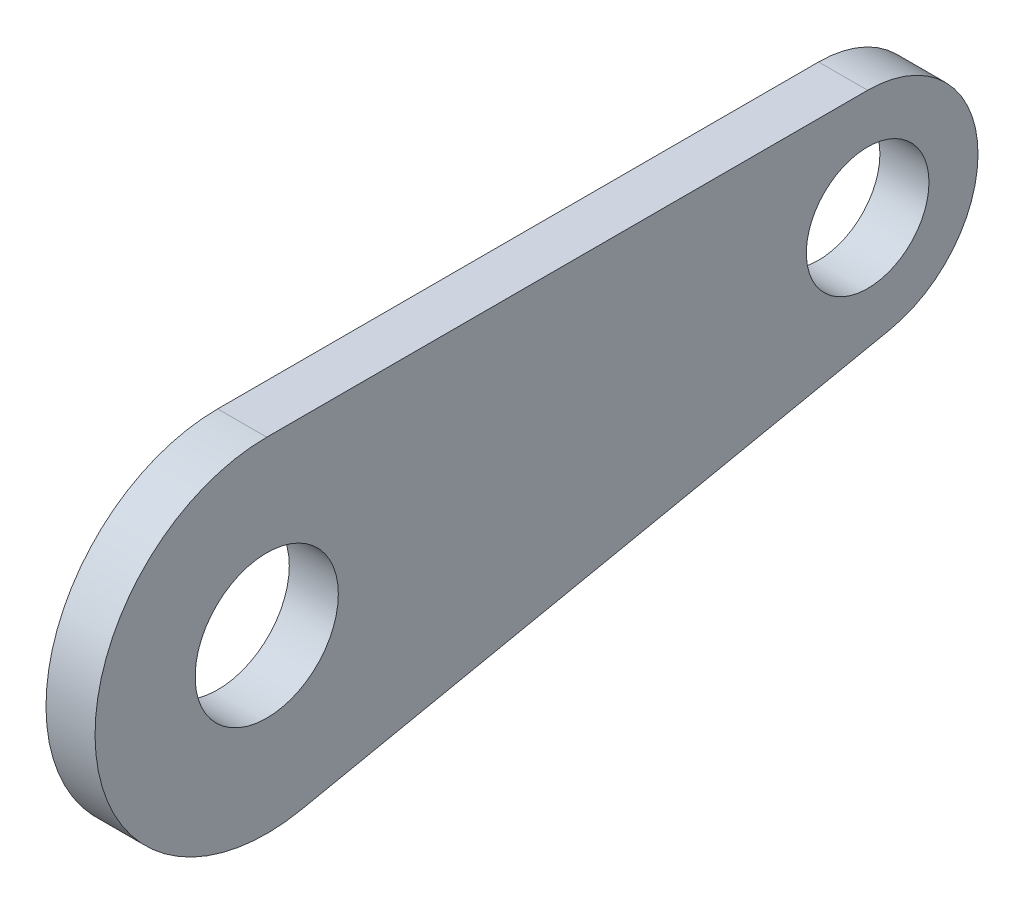
ISO-10303-21;
HEADER;
FILE_DESCRIPTION(('STEP AP214'),'2;1');
FILE_NAME('part.step','',(''),(''),'','','');
FILE_SCHEMA(('AUTOMOTIVE_DESIGN { 1 0 10303 214 1 1 1 1 }'));
ENDSEC;
DATA;
#1=APPLICATION_CONTEXT('core data for automotive mechanical design processes');
#2=APPLICATION_PROTOCOL_DEFINITION('international standard','automotive_design',2000,#1);
#3=PRODUCT_CONTEXT('',#1,'mechanical');
#4=PRODUCT('Part','Part','',(#3));
#5=PRODUCT_RELATED_PRODUCT_CATEGORY('part','',(#4));
#6=PRODUCT_DEFINITION_FORMATION('','',#4);
#7=PRODUCT_DEFINITION_CONTEXT('part definition',#1,'design');
#8=PRODUCT_DEFINITION('design','',#6,#7);
#9=PRODUCT_DEFINITION_SHAPE('','',#8);
#10=(LENGTH_UNIT() NAMED_UNIT(*) SI_UNIT(.MILLI.,.METRE.));
#11=(NAMED_UNIT(*) PLANE_ANGLE_UNIT() SI_UNIT($,.RADIAN.));
#12=(NAMED_UNIT(*) SI_UNIT($,.STERADIAN.) SOLID_ANGLE_UNIT());
#13=UNCERTAINTY_MEASURE_WITH_UNIT(LENGTH_MEASURE(1.E-05),#10,'distance_accuracy_value','');
#14=(GEOMETRIC_REPRESENTATION_CONTEXT(3) GLOBAL_UNCERTAINTY_ASSIGNED_CONTEXT((#13)) GLOBAL_UNIT_ASSIGNED_CONTEXT((#10,
#11,#12)) REPRESENTATION_CONTEXT('',''));
#15=CARTESIAN_POINT('',(0.,0.,0.));
#16=DIRECTION('',(0.,0.,1.));
#17=DIRECTION('',(1.,0.,0.));
#18=AXIS2_PLACEMENT_3D('',#15,#16,#17);
#19=CARTESIAN_POINT('',(-1.6129,0.,14.4455782844468));
#20=DIRECTION('',(1.,0.,0.));
#21=DIRECTION('',(0.,0.,-1.));
#22=AXIS2_PLACEMENT_3D('',#19,#20,#21);
#23=CYLINDRICAL_SURFACE('',#22,5.64642);
#24=CARTESIAN_POINT('',(0.,0.,14.4455782844468));
#25=DIRECTION('',(1.,0.,0.));
#26=DIRECTION('',(0.,0.,-1.));
#27=AXIS2_PLACEMENT_3D('',#24,#25,#26);
#28=CIRCLE('',#27,5.64642);
#29=CARTESIAN_POINT('',(0.,5.64642,14.4455782844468));
#30=VERTEX_POINT('',#29);
#31=CARTESIAN_POINT('',(0.,-5.53001142613113,13.3049501928854));
#32=VERTEX_POINT('',#31);
#33=EDGE_CURVE('E97',#30,#32,#28,.T.);
#34=ORIENTED_EDGE('',*,*,#33,.F.);
#35=DIRECTION('',(1.,0.,0.));
#36=VECTOR('',#35,1.);
#37=CARTESIAN_POINT('',(-1.6129,5.64642,14.4455782844468));
#38=LINE('',#37,#36);
#39=CARTESIAN_POINT('',(-1.6129,5.64642,14.4455782844468));
#40=VERTEX_POINT('',#39);
#41=EDGE_CURVE('E11',#40,#30,#38,.T.);
#42=ORIENTED_EDGE('',*,*,#41,.F.);
#43=CARTESIAN_POINT('',(-1.6129,0.,14.4455782844468));
#44=DIRECTION('',(1.,0.,0.));
#45=DIRECTION('',(0.,0.,-1.));
#46=AXIS2_PLACEMENT_3D('',#43,#44,#45);
#47=CIRCLE('',#46,5.64642);
#48=CARTESIAN_POINT('',(-1.6129,-5.53001142613113,13.3049501928854));
#49=VERTEX_POINT('',#48);
#50=EDGE_CURVE('E90',#40,#49,#47,.T.);
#51=ORIENTED_EDGE('',*,*,#50,.T.);
#52=DIRECTION('',(1.,0.,0.));
#53=VECTOR('',#52,1.);
#54=CARTESIAN_POINT('',(-1.6129,-5.53001142613113,13.3049501928854));
#55=LINE('',#54,#53);
#56=EDGE_CURVE('E35',#49,#32,#55,.T.);
#57=ORIENTED_EDGE('',*,*,#56,.T.);
#58=EDGE_LOOP('',(#34,#42,#51,#57));
#59=FACE_BOUND('',#58,.T.);
#60=ADVANCED_FACE('F32',(#59),#23,.T.);
#61=CARTESIAN_POINT('',(-1.6129,5.64642,14.4455782844468));
#62=DIRECTION('',(0.,1.,0.));
#63=DIRECTION('',(0.,0.,1.));
#64=AXIS2_PLACEMENT_3D('',#61,#62,#63);
#65=PLANE('',#64);
#66=DIRECTION('',(0.,0.,1.));
#67=VECTOR('',#66,1.);
#68=CARTESIAN_POINT('',(0.,5.64642,14.4455782844468));
#69=LINE('',#68,#67);
#70=CARTESIAN_POINT('',(0.,5.64642,-5.31562171555319));
#71=VERTEX_POINT('',#70);
#72=EDGE_CURVE('E92',#71,#30,#69,.T.);
#73=ORIENTED_EDGE('',*,*,#72,.F.);
#74=DIRECTION('',(1.,0.,0.));
#75=VECTOR('',#74,1.);
#76=CARTESIAN_POINT('',(-1.6129,5.64642,-5.31562171555319));
#77=LINE('',#76,#75);
#78=CARTESIAN_POINT('',(-1.6129,5.64642,-5.31562171555319));
#79=VERTEX_POINT('',#78);
#80=EDGE_CURVE('E41',#79,#71,#77,.T.);
#81=ORIENTED_EDGE('',*,*,#80,.F.);
#82=DIRECTION('',(0.,0.,1.));
#83=VECTOR('',#82,1.);
#84=CARTESIAN_POINT('',(-1.6129,5.64642,14.4455782844468));
#85=LINE('',#84,#83);
#86=EDGE_CURVE('E87',#79,#40,#85,.T.);
#87=ORIENTED_EDGE('',*,*,#86,.T.);
#88=ORIENTED_EDGE('',*,*,#41,.T.);
#89=EDGE_LOOP('',(#73,#81,#87,#88));
#90=FACE_BOUND('',#89,.T.);
#91=ADVANCED_FACE('F108',(#90),#65,.T.);
#92=CARTESIAN_POINT('',(-1.6129,2.01676,-5.31562171555319));
#93=DIRECTION('',(1.,0.,0.));
#94=DIRECTION('',(0.,0.,-1.));
#95=AXIS2_PLACEMENT_3D('',#92,#93,#94);
#96=CYLINDRICAL_SURFACE('',#95,3.62966);
#97=CARTESIAN_POINT('',(0.,2.01676,-5.31562171555319));
#98=DIRECTION('',(1.,0.,0.));
#99=DIRECTION('',(0.,0.,-1.));
#100=AXIS2_PLACEMENT_3D('',#97,#98,#99);
#101=CIRCLE('',#100,3.62966);
#102=CARTESIAN_POINT('',(0.,-1.53806965719361,-6.04884598133876));
#103=VERTEX_POINT('',#102);
#104=EDGE_CURVE('E82',#103,#71,#101,.T.);
#105=ORIENTED_EDGE('',*,*,#104,.F.);
#106=DIRECTION('',(1.,0.,0.));
#107=VECTOR('',#106,1.);
#108=CARTESIAN_POINT('',(-1.6129,-1.53806965719361,-6.04884598133876));
#109=LINE('',#108,#107);
#110=CARTESIAN_POINT('',(-1.6129,-1.53806965719361,-6.04884598133876));
#111=VERTEX_POINT('',#110);
#112=EDGE_CURVE('E77',#111,#103,#109,.T.);
#113=ORIENTED_EDGE('',*,*,#112,.F.);
#114=CARTESIAN_POINT('',(-1.6129,2.01676,-5.31562171555319));
#115=DIRECTION('',(1.,0.,0.));
#116=DIRECTION('',(0.,0.,-1.));
#117=AXIS2_PLACEMENT_3D('',#114,#115,#116);
#118=CIRCLE('',#117,3.62966);
#119=EDGE_CURVE('E80',#111,#79,#118,.T.);
#120=ORIENTED_EDGE('',*,*,#119,.T.);
#121=ORIENTED_EDGE('',*,*,#80,.T.);
#122=EDGE_LOOP('',(#105,#113,#120,#121));
#123=FACE_BOUND('',#122,.T.);
#124=ADVANCED_FACE('F79',(#123),#96,.T.);
#125=CARTESIAN_POINT('',(-1.6129,-5.53001142613113,13.3049501928854));
#126=DIRECTION('',(0.,-0.979383649486069,-0.202009076824157));
#127=DIRECTION('',(0.,0.202009076824157,-0.97938364948607));
#128=AXIS2_PLACEMENT_3D('',#125,#126,#127);
#129=PLANE('',#128);
#130=DIRECTION('',(0.,0.202009076824157,-0.979383649486069));
#131=VECTOR('',#130,1.);
#132=CARTESIAN_POINT('',(0.,-5.53001142613113,13.3049501928854));
#133=LINE('',#132,#131);
#134=EDGE_CURVE('E100',#32,#103,#133,.T.);
#135=ORIENTED_EDGE('',*,*,#134,.F.);
#136=ORIENTED_EDGE('',*,*,#56,.F.);
#137=DIRECTION('',(0.,0.202009076824157,-0.979383649486069));
#138=VECTOR('',#137,1.);
#139=CARTESIAN_POINT('',(-1.6129,-5.53001142613113,13.3049501928854));
#140=LINE('',#139,#138);
#141=EDGE_CURVE('E86',#49,#111,#140,.T.);
#142=ORIENTED_EDGE('',*,*,#141,.T.);
#143=ORIENTED_EDGE('',*,*,#112,.T.);
#144=EDGE_LOOP('',(#135,#136,#142,#143));
#145=FACE_BOUND('',#144,.T.);
#146=ADVANCED_FACE('F89',(#145),#129,.T.);
#147=CARTESIAN_POINT('',(-1.6129,0.,14.4455782844468));
#148=DIRECTION('',(1.,0.,0.));
#149=DIRECTION('',(0.,0.,-1.));
#150=AXIS2_PLACEMENT_3D('',#147,#148,#149);
#151=PLANE('',#150);
#152=CARTESIAN_POINT('',(-1.6129,2.01676,-5.31562171555319));
#153=DIRECTION('',(1.,0.,0.));
#154=DIRECTION('',(0.,0.,-1.));
#155=AXIS2_PLACEMENT_3D('',#152,#153,#154);
#156=CIRCLE('',#155,2.01676);
#157=CARTESIAN_POINT('',(-1.6129,2.01676,-7.33238171555319));
#158=VERTEX_POINT('',#157);
#159=EDGE_CURVE('E141',#158,#158,#156,.T.);
#160=ORIENTED_EDGE('',*,*,#159,.T.);
#161=EDGE_LOOP('',(#160));
#162=FACE_BOUND('',#161,.T.);
#163=CARTESIAN_POINT('',(-1.6129,0.,14.4455782844468));
#164=DIRECTION('',(1.,0.,0.));
#165=DIRECTION('',(0.,0.,-1.));
#166=AXIS2_PLACEMENT_3D('',#163,#164,#165);
#167=CIRCLE('',#166,2.35458);
#168=CARTESIAN_POINT('',(-1.6129,0.,12.0909982844468));
#169=VERTEX_POINT('',#168);
#170=EDGE_CURVE('E101',#169,#169,#167,.T.);
#171=ORIENTED_EDGE('',*,*,#170,.T.);
#172=EDGE_LOOP('',(#171));
#173=FACE_BOUND('',#172,.T.);
#174=ORIENTED_EDGE('',*,*,#50,.F.);
#175=ORIENTED_EDGE('',*,*,#86,.F.);
#176=ORIENTED_EDGE('',*,*,#119,.F.);
#177=ORIENTED_EDGE('',*,*,#141,.F.);
#178=EDGE_LOOP('',(#174,#175,#176,#177));
#179=FACE_BOUND('',#178,.T.);
#180=ADVANCED_FACE('F85',(#162,#173,#179),#151,.F.);
#181=CARTESIAN_POINT('',(0.,0.,14.4455782844468));
#182=DIRECTION('',(1.,0.,0.));
#183=DIRECTION('',(0.,0.,-1.));
#184=AXIS2_PLACEMENT_3D('',#181,#182,#183);
#185=PLANE('',#184);
#186=CARTESIAN_POINT('',(0.,2.01676,-5.31562171555319));
#187=DIRECTION('',(1.,0.,0.));
#188=DIRECTION('',(0.,0.,-1.));
#189=AXIS2_PLACEMENT_3D('',#186,#187,#188);
#190=CIRCLE('',#189,2.01676);
#191=CARTESIAN_POINT('',(0.,2.01676,-7.33238171555319));
#192=VERTEX_POINT('',#191);
#193=EDGE_CURVE('E144',#192,#192,#190,.T.);
#194=ORIENTED_EDGE('',*,*,#193,.F.);
#195=EDGE_LOOP('',(#194));
#196=FACE_BOUND('',#195,.T.);
#197=CARTESIAN_POINT('',(0.,0.,14.4455782844468));
#198=DIRECTION('',(1.,0.,0.));
#199=DIRECTION('',(0.,0.,-1.));
#200=AXIS2_PLACEMENT_3D('',#197,#198,#199);
#201=CIRCLE('',#200,2.35458);
#202=CARTESIAN_POINT('',(0.,0.,12.0909982844468));
#203=VERTEX_POINT('',#202);
#204=EDGE_CURVE('E146',#203,#203,#201,.T.);
#205=ORIENTED_EDGE('',*,*,#204,.F.);
#206=EDGE_LOOP('',(#205));
#207=FACE_BOUND('',#206,.T.);
#208=ORIENTED_EDGE('',*,*,#33,.T.);
#209=ORIENTED_EDGE('',*,*,#134,.T.);
#210=ORIENTED_EDGE('',*,*,#104,.T.);
#211=ORIENTED_EDGE('',*,*,#72,.T.);
#212=EDGE_LOOP('',(#208,#209,#210,#211));
#213=FACE_BOUND('',#212,.T.);
#214=ADVANCED_FACE('F107',(#196,#207,#213),#185,.T.);
#215=CARTESIAN_POINT('',(-1.6129,0.,14.4455782844468));
#216=DIRECTION('',(1.,0.,0.));
#217=DIRECTION('',(0.,0.,-1.));
#218=AXIS2_PLACEMENT_3D('',#215,#216,#217);
#219=CYLINDRICAL_SURFACE('',#218,2.35458);
#220=ORIENTED_EDGE('',*,*,#170,.F.);
#221=EDGE_LOOP('',(#220));
#222=FACE_BOUND('',#221,.T.);
#223=ORIENTED_EDGE('',*,*,#204,.T.);
#224=EDGE_LOOP('',(#223));
#225=FACE_BOUND('',#224,.T.);
#226=ADVANCED_FACE('F126',(#222,#225),#219,.F.);
#227=CARTESIAN_POINT('',(-1.6129,2.01676,-5.31562171555319));
#228=DIRECTION('',(1.,0.,0.));
#229=DIRECTION('',(0.,0.,-1.));
#230=AXIS2_PLACEMENT_3D('',#227,#228,#229);
#231=CYLINDRICAL_SURFACE('',#230,2.01676);
#232=ORIENTED_EDGE('',*,*,#159,.F.);
#233=EDGE_LOOP('',(#232));
#234=FACE_BOUND('',#233,.T.);
#235=ORIENTED_EDGE('',*,*,#193,.T.);
#236=EDGE_LOOP('',(#235));
#237=FACE_BOUND('',#236,.T.);
#238=ADVANCED_FACE('F133',(#234,#237),#231,.F.);
#239=CLOSED_SHELL('',(#60,#91,#124,#146,#180,#214,#226,#238));
#240=MANIFOLD_SOLID_BREP('B2',#239);
#241=ADVANCED_BREP_SHAPE_REPRESENTATION('',(#18,#240),#14);
#242=SHAPE_DEFINITION_REPRESENTATION(#9,#241);
ENDSEC;
END-ISO-10303-21;
